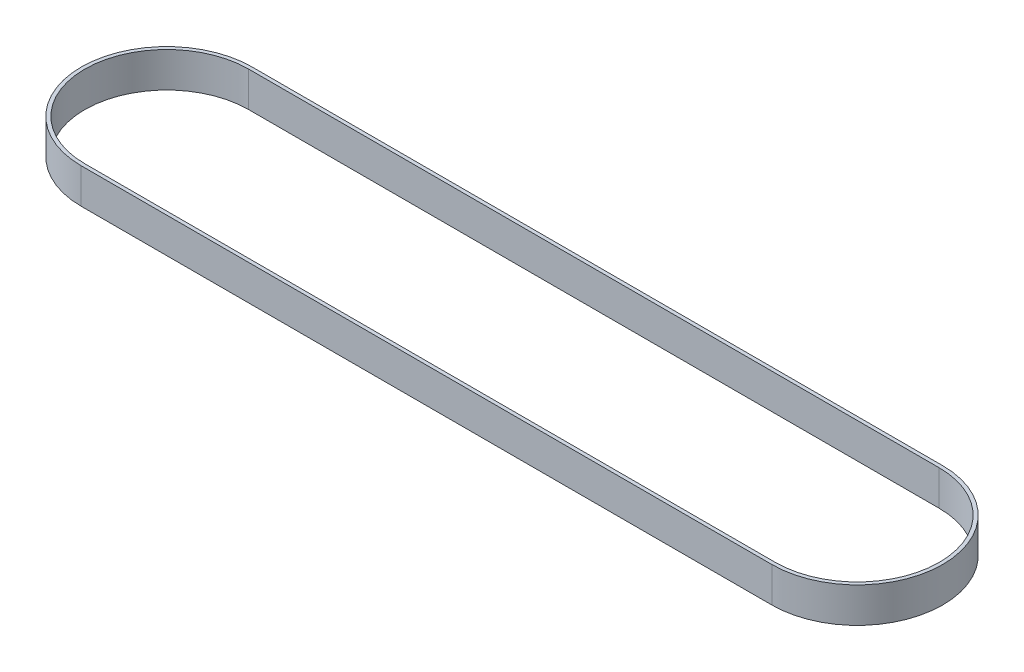
ISO-10303-21;
HEADER;
FILE_DESCRIPTION(('STEP AP214'),'2;1');
FILE_NAME('part.step','',(''),(''),'','','');
FILE_SCHEMA(('AUTOMOTIVE_DESIGN { 1 0 10303 214 1 1 1 1 }'));
ENDSEC;
DATA;
#1=APPLICATION_CONTEXT('core data for automotive mechanical design processes');
#2=APPLICATION_PROTOCOL_DEFINITION('international standard','automotive_design',2000,#1);
#3=PRODUCT_CONTEXT('',#1,'mechanical');
#4=PRODUCT('Part','Part','',(#3));
#5=PRODUCT_RELATED_PRODUCT_CATEGORY('part','',(#4));
#6=PRODUCT_DEFINITION_FORMATION('','',#4);
#7=PRODUCT_DEFINITION_CONTEXT('part definition',#1,'design');
#8=PRODUCT_DEFINITION('design','',#6,#7);
#9=PRODUCT_DEFINITION_SHAPE('','',#8);
#10=(LENGTH_UNIT() NAMED_UNIT(*) SI_UNIT(.MILLI.,.METRE.));
#11=(NAMED_UNIT(*) PLANE_ANGLE_UNIT() SI_UNIT($,.RADIAN.));
#12=(NAMED_UNIT(*) SI_UNIT($,.STERADIAN.) SOLID_ANGLE_UNIT());
#13=UNCERTAINTY_MEASURE_WITH_UNIT(LENGTH_MEASURE(1.E-05),#10,'distance_accuracy_value','');
#14=(GEOMETRIC_REPRESENTATION_CONTEXT(3) GLOBAL_UNCERTAINTY_ASSIGNED_CONTEXT((#13)) GLOBAL_UNIT_ASSIGNED_CONTEXT((#10,
#11,#12)) REPRESENTATION_CONTEXT('',''));
#15=CARTESIAN_POINT('',(0.,0.,0.));
#16=DIRECTION('',(0.,0.,1.));
#17=DIRECTION('',(1.,0.,0.));
#18=AXIS2_PLACEMENT_3D('',#15,#16,#17);
#19=CARTESIAN_POINT('',(0.,15.,-35.0139));
#20=DIRECTION('',(0.,0.,1.));
#21=DIRECTION('',(1.,0.,0.));
#22=AXIS2_PLACEMENT_3D('',#19,#20,#21);
#23=PLANE('',#22);
#24=DIRECTION('',(-1.,0.,0.));
#25=VECTOR('',#24,1.);
#26=CARTESIAN_POINT('',(0.,0.,-35.0139));
#27=LINE('',#26,#25);
#28=CARTESIAN_POINT('',(295.0718,0.,-35.0139));
#29=VERTEX_POINT('',#28);
#30=CARTESIAN_POINT('',(0.,0.,-35.0139));
#31=VERTEX_POINT('',#30);
#32=EDGE_CURVE('E122',#29,#31,#27,.T.);
#33=ORIENTED_EDGE('',*,*,#32,.F.);
#34=DIRECTION('',(0.,-1.,0.));
#35=VECTOR('',#34,1.);
#36=CARTESIAN_POINT('',(295.0718,15.,-35.0139));
#37=LINE('',#36,#35);
#38=CARTESIAN_POINT('',(295.0718,15.,-35.0139));
#39=VERTEX_POINT('',#38);
#40=EDGE_CURVE('E11',#39,#29,#37,.T.);
#41=ORIENTED_EDGE('',*,*,#40,.F.);
#42=DIRECTION('',(-1.,0.,0.));
#43=VECTOR('',#42,1.);
#44=CARTESIAN_POINT('',(0.,15.,-35.0139));
#45=LINE('',#44,#43);
#46=CARTESIAN_POINT('',(0.,15.,-35.0139));
#47=VERTEX_POINT('',#46);
#48=EDGE_CURVE('E159',#39,#47,#45,.T.);
#49=ORIENTED_EDGE('',*,*,#48,.T.);
#50=DIRECTION('',(0.,-1.,0.));
#51=VECTOR('',#50,1.);
#52=CARTESIAN_POINT('',(0.,15.,-35.0139));
#53=LINE('',#52,#51);
#54=EDGE_CURVE('E52',#47,#31,#53,.T.);
#55=ORIENTED_EDGE('',*,*,#54,.T.);
#56=EDGE_LOOP('',(#33,#41,#49,#55));
#57=FACE_BOUND('',#56,.T.);
#58=ADVANCED_FACE('F16',(#57),#23,.T.);
#59=CARTESIAN_POINT('',(295.0718,15.,0.));
#60=DIRECTION('',(0.,-1.,0.));
#61=DIRECTION('',(0.,0.,-1.));
#62=AXIS2_PLACEMENT_3D('',#59,#60,#61);
#63=CYLINDRICAL_SURFACE('',#62,35.0139);
#64=CARTESIAN_POINT('',(295.0718,0.,0.));
#65=DIRECTION('',(0.,1.,0.));
#66=DIRECTION('',(0.,0.,1.));
#67=AXIS2_PLACEMENT_3D('',#64,#65,#66);
#68=CIRCLE('',#67,35.0139);
#69=CARTESIAN_POINT('',(295.0718,0.,35.0139));
#70=VERTEX_POINT('',#69);
#71=EDGE_CURVE('E173',#70,#29,#68,.T.);
#72=ORIENTED_EDGE('',*,*,#71,.F.);
#73=DIRECTION('',(0.,-1.,0.));
#74=VECTOR('',#73,1.);
#75=CARTESIAN_POINT('',(295.0718,15.,35.0139));
#76=LINE('',#75,#74);
#77=CARTESIAN_POINT('',(295.0718,15.,35.0139));
#78=VERTEX_POINT('',#77);
#79=EDGE_CURVE('E25',#78,#70,#76,.T.);
#80=ORIENTED_EDGE('',*,*,#79,.F.);
#81=CARTESIAN_POINT('',(295.0718,15.,0.));
#82=DIRECTION('',(0.,1.,0.));
#83=DIRECTION('',(0.,0.,1.));
#84=AXIS2_PLACEMENT_3D('',#81,#82,#83);
#85=CIRCLE('',#84,35.0139);
#86=EDGE_CURVE('E156',#78,#39,#85,.T.);
#87=ORIENTED_EDGE('',*,*,#86,.T.);
#88=ORIENTED_EDGE('',*,*,#40,.T.);
#89=EDGE_LOOP('',(#72,#80,#87,#88));
#90=FACE_BOUND('',#89,.T.);
#91=ADVANCED_FACE('F205',(#90),#63,.F.);
#92=CARTESIAN_POINT('',(0.,15.,35.0139));
#93=DIRECTION('',(0.,0.,-1.));
#94=DIRECTION('',(-1.,0.,0.));
#95=AXIS2_PLACEMENT_3D('',#92,#93,#94);
#96=PLANE('',#95);
#97=DIRECTION('',(1.,0.,0.));
#98=VECTOR('',#97,1.);
#99=CARTESIAN_POINT('',(0.,0.,35.0139));
#100=LINE('',#99,#98);
#101=CARTESIAN_POINT('',(0.,0.,35.0139));
#102=VERTEX_POINT('',#101);
#103=EDGE_CURVE('E177',#102,#70,#100,.T.);
#104=ORIENTED_EDGE('',*,*,#103,.F.);
#105=DIRECTION('',(0.,-1.,0.));
#106=VECTOR('',#105,1.);
#107=CARTESIAN_POINT('',(0.,15.,35.0139));
#108=LINE('',#107,#106);
#109=CARTESIAN_POINT('',(0.,15.,35.0139));
#110=VERTEX_POINT('',#109);
#111=EDGE_CURVE('E195',#110,#102,#108,.T.);
#112=ORIENTED_EDGE('',*,*,#111,.F.);
#113=DIRECTION('',(1.,0.,0.));
#114=VECTOR('',#113,1.);
#115=CARTESIAN_POINT('',(0.,15.,35.0139));
#116=LINE('',#115,#114);
#117=EDGE_CURVE('E142',#110,#78,#116,.T.);
#118=ORIENTED_EDGE('',*,*,#117,.T.);
#119=ORIENTED_EDGE('',*,*,#79,.T.);
#120=EDGE_LOOP('',(#104,#112,#118,#119));
#121=FACE_BOUND('',#120,.T.);
#122=ADVANCED_FACE('F202',(#121),#96,.T.);
#123=CARTESIAN_POINT('',(0.,15.,0.));
#124=DIRECTION('',(0.,-1.,0.));
#125=DIRECTION('',(0.,0.,-1.));
#126=AXIS2_PLACEMENT_3D('',#123,#124,#125);
#127=CYLINDRICAL_SURFACE('',#126,35.0139);
#128=CARTESIAN_POINT('',(0.,0.,0.));
#129=DIRECTION('',(0.,1.,0.));
#130=DIRECTION('',(0.,0.,1.));
#131=AXIS2_PLACEMENT_3D('',#128,#129,#130);
#132=CIRCLE('',#131,35.0139);
#133=EDGE_CURVE('E172',#31,#102,#132,.T.);
#134=ORIENTED_EDGE('',*,*,#133,.F.);
#135=ORIENTED_EDGE('',*,*,#54,.F.);
#136=CARTESIAN_POINT('',(0.,15.,0.));
#137=DIRECTION('',(0.,1.,0.));
#138=DIRECTION('',(0.,0.,1.));
#139=AXIS2_PLACEMENT_3D('',#136,#137,#138);
#140=CIRCLE('',#139,35.0139);
#141=EDGE_CURVE('E145',#47,#110,#140,.T.);
#142=ORIENTED_EDGE('',*,*,#141,.T.);
#143=ORIENTED_EDGE('',*,*,#111,.T.);
#144=EDGE_LOOP('',(#134,#135,#142,#143));
#145=FACE_BOUND('',#144,.T.);
#146=ADVANCED_FACE('F211',(#145),#127,.F.);
#147=CARTESIAN_POINT('',(0.,15.,-36.5379));
#148=DIRECTION('',(0.,0.,1.));
#149=DIRECTION('',(1.,0.,0.));
#150=AXIS2_PLACEMENT_3D('',#147,#148,#149);
#151=PLANE('',#150);
#152=DIRECTION('',(-1.,0.,0.));
#153=VECTOR('',#152,1.);
#154=CARTESIAN_POINT('',(0.,0.,-36.5379));
#155=LINE('',#154,#153);
#156=CARTESIAN_POINT('',(295.0718,0.,-36.5379));
#157=VERTEX_POINT('',#156);
#158=CARTESIAN_POINT('',(0.,0.,-36.5379));
#159=VERTEX_POINT('',#158);
#160=EDGE_CURVE('E151',#157,#159,#155,.T.);
#161=ORIENTED_EDGE('',*,*,#160,.T.);
#162=DIRECTION('',(0.,-1.,0.));
#163=VECTOR('',#162,1.);
#164=CARTESIAN_POINT('',(0.,15.,-36.5379));
#165=LINE('',#164,#163);
#166=CARTESIAN_POINT('',(0.,15.,-36.5379));
#167=VERTEX_POINT('',#166);
#168=EDGE_CURVE('E121',#167,#159,#165,.T.);
#169=ORIENTED_EDGE('',*,*,#168,.F.);
#170=DIRECTION('',(-1.,0.,0.));
#171=VECTOR('',#170,1.);
#172=CARTESIAN_POINT('',(0.,15.,-36.5379));
#173=LINE('',#172,#171);
#174=CARTESIAN_POINT('',(295.0718,15.,-36.5379));
#175=VERTEX_POINT('',#174);
#176=EDGE_CURVE('E135',#175,#167,#173,.T.);
#177=ORIENTED_EDGE('',*,*,#176,.F.);
#178=DIRECTION('',(0.,-1.,0.));
#179=VECTOR('',#178,1.);
#180=CARTESIAN_POINT('',(295.0718,15.,-36.5379));
#181=LINE('',#180,#179);
#182=EDGE_CURVE('E190',#175,#157,#181,.T.);
#183=ORIENTED_EDGE('',*,*,#182,.T.);
#184=EDGE_LOOP('',(#161,#169,#177,#183));
#185=FACE_BOUND('',#184,.T.);
#186=ADVANCED_FACE('F229',(#185),#151,.F.);
#187=CARTESIAN_POINT('',(295.0718,15.,0.));
#188=DIRECTION('',(0.,-1.,0.));
#189=DIRECTION('',(0.,0.,-1.));
#190=AXIS2_PLACEMENT_3D('',#187,#188,#189);
#191=CYLINDRICAL_SURFACE('',#190,36.5379);
#192=CARTESIAN_POINT('',(295.0718,0.,0.));
#193=DIRECTION('',(0.,1.,0.));
#194=DIRECTION('',(0.,0.,1.));
#195=AXIS2_PLACEMENT_3D('',#192,#193,#194);
#196=CIRCLE('',#195,36.5379);
#197=CARTESIAN_POINT('',(295.0718,0.,36.5379));
#198=VERTEX_POINT('',#197);
#199=EDGE_CURVE('E147',#198,#157,#196,.T.);
#200=ORIENTED_EDGE('',*,*,#199,.T.);
#201=ORIENTED_EDGE('',*,*,#182,.F.);
#202=CARTESIAN_POINT('',(295.0718,15.,0.));
#203=DIRECTION('',(0.,1.,0.));
#204=DIRECTION('',(0.,0.,1.));
#205=AXIS2_PLACEMENT_3D('',#202,#203,#204);
#206=CIRCLE('',#205,36.5379);
#207=CARTESIAN_POINT('',(295.0718,15.,36.5379));
#208=VERTEX_POINT('',#207);
#209=EDGE_CURVE('E130',#208,#175,#206,.T.);
#210=ORIENTED_EDGE('',*,*,#209,.F.);
#211=DIRECTION('',(0.,-1.,0.));
#212=VECTOR('',#211,1.);
#213=CARTESIAN_POINT('',(295.0718,15.,36.5379));
#214=LINE('',#213,#212);
#215=EDGE_CURVE('E66',#208,#198,#214,.T.);
#216=ORIENTED_EDGE('',*,*,#215,.T.);
#217=EDGE_LOOP('',(#200,#201,#210,#216));
#218=FACE_BOUND('',#217,.T.);
#219=ADVANCED_FACE('F230',(#218),#191,.T.);
#220=CARTESIAN_POINT('',(0.,15.,36.5379));
#221=DIRECTION('',(0.,0.,-1.));
#222=DIRECTION('',(0.,-1.,0.));
#223=AXIS2_PLACEMENT_3D('',#220,#221,#222);
#224=PLANE('',#223);
#225=DIRECTION('',(1.,0.,0.));
#226=VECTOR('',#225,1.);
#227=CARTESIAN_POINT('',(0.,0.,36.5379));
#228=LINE('',#227,#226);
#229=CARTESIAN_POINT('',(0.,0.,36.5379));
#230=VERTEX_POINT('',#229);
#231=EDGE_CURVE('E150',#230,#198,#228,.T.);
#232=ORIENTED_EDGE('',*,*,#231,.T.);
#233=ORIENTED_EDGE('',*,*,#215,.F.);
#234=DIRECTION('',(1.,0.,0.));
#235=VECTOR('',#234,1.);
#236=CARTESIAN_POINT('',(0.,15.,36.5379));
#237=LINE('',#236,#235);
#238=CARTESIAN_POINT('',(0.,15.,36.5379));
#239=VERTEX_POINT('',#238);
#240=EDGE_CURVE('E125',#239,#208,#237,.T.);
#241=ORIENTED_EDGE('',*,*,#240,.F.);
#242=DIRECTION('',(0.,-1.,0.));
#243=VECTOR('',#242,1.);
#244=CARTESIAN_POINT('',(0.,15.,36.5379));
#245=LINE('',#244,#243);
#246=EDGE_CURVE('E111',#239,#230,#245,.T.);
#247=ORIENTED_EDGE('',*,*,#246,.T.);
#248=EDGE_LOOP('',(#232,#233,#241,#247));
#249=FACE_BOUND('',#248,.T.);
#250=ADVANCED_FACE('F126',(#249),#224,.F.);
#251=CARTESIAN_POINT('',(0.,15.,0.));
#252=DIRECTION('',(0.,-1.,0.));
#253=DIRECTION('',(0.,0.,-1.));
#254=AXIS2_PLACEMENT_3D('',#251,#252,#253);
#255=CYLINDRICAL_SURFACE('',#254,36.5379);
#256=CARTESIAN_POINT('',(0.,0.,0.));
#257=DIRECTION('',(0.,1.,0.));
#258=DIRECTION('',(0.,0.,1.));
#259=AXIS2_PLACEMENT_3D('',#256,#257,#258);
#260=CIRCLE('',#259,36.5379);
#261=EDGE_CURVE('E117',#159,#230,#260,.T.);
#262=ORIENTED_EDGE('',*,*,#261,.T.);
#263=ORIENTED_EDGE('',*,*,#246,.F.);
#264=CARTESIAN_POINT('',(0.,15.,0.));
#265=DIRECTION('',(0.,1.,0.));
#266=DIRECTION('',(0.,0.,1.));
#267=AXIS2_PLACEMENT_3D('',#264,#265,#266);
#268=CIRCLE('',#267,36.5379);
#269=EDGE_CURVE('E115',#167,#239,#268,.T.);
#270=ORIENTED_EDGE('',*,*,#269,.F.);
#271=ORIENTED_EDGE('',*,*,#168,.T.);
#272=EDGE_LOOP('',(#262,#263,#270,#271));
#273=FACE_BOUND('',#272,.T.);
#274=ADVANCED_FACE('F113',(#273),#255,.T.);
#275=CARTESIAN_POINT('',(0.,0.,0.));
#276=DIRECTION('',(0.,1.,0.));
#277=DIRECTION('',(1.,0.,0.));
#278=AXIS2_PLACEMENT_3D('',#275,#276,#277);
#279=PLANE('',#278);
#280=ORIENTED_EDGE('',*,*,#133,.T.);
#281=ORIENTED_EDGE('',*,*,#103,.T.);
#282=ORIENTED_EDGE('',*,*,#71,.T.);
#283=ORIENTED_EDGE('',*,*,#32,.T.);
#284=EDGE_LOOP('',(#280,#281,#282,#283));
#285=FACE_BOUND('',#284,.T.);
#286=ORIENTED_EDGE('',*,*,#261,.F.);
#287=ORIENTED_EDGE('',*,*,#160,.F.);
#288=ORIENTED_EDGE('',*,*,#199,.F.);
#289=ORIENTED_EDGE('',*,*,#231,.F.);
#290=EDGE_LOOP('',(#286,#287,#288,#289));
#291=FACE_BOUND('',#290,.T.);
#292=ADVANCED_FACE('F207',(#285,#291),#279,.F.);
#293=CARTESIAN_POINT('',(0.,15.,0.));
#294=DIRECTION('',(0.,1.,0.));
#295=DIRECTION('',(1.,0.,0.));
#296=AXIS2_PLACEMENT_3D('',#293,#294,#295);
#297=PLANE('',#296);
#298=ORIENTED_EDGE('',*,*,#117,.F.);
#299=ORIENTED_EDGE('',*,*,#141,.F.);
#300=ORIENTED_EDGE('',*,*,#48,.F.);
#301=ORIENTED_EDGE('',*,*,#86,.F.);
#302=EDGE_LOOP('',(#298,#299,#300,#301));
#303=FACE_BOUND('',#302,.T.);
#304=ORIENTED_EDGE('',*,*,#269,.T.);
#305=ORIENTED_EDGE('',*,*,#240,.T.);
#306=ORIENTED_EDGE('',*,*,#209,.T.);
#307=ORIENTED_EDGE('',*,*,#176,.T.);
#308=EDGE_LOOP('',(#304,#305,#306,#307));
#309=FACE_BOUND('',#308,.T.);
#310=ADVANCED_FACE('F133',(#303,#309),#297,.T.);
#311=CLOSED_SHELL('',(#58,#91,#122,#146,#186,#219,#250,#274,#292,#310));
#312=MANIFOLD_SOLID_BREP('B1',#311);
#313=ADVANCED_BREP_SHAPE_REPRESENTATION('',(#18,#312),#14);
#314=SHAPE_DEFINITION_REPRESENTATION(#9,#313);
ENDSEC;
END-ISO-10303-21;
